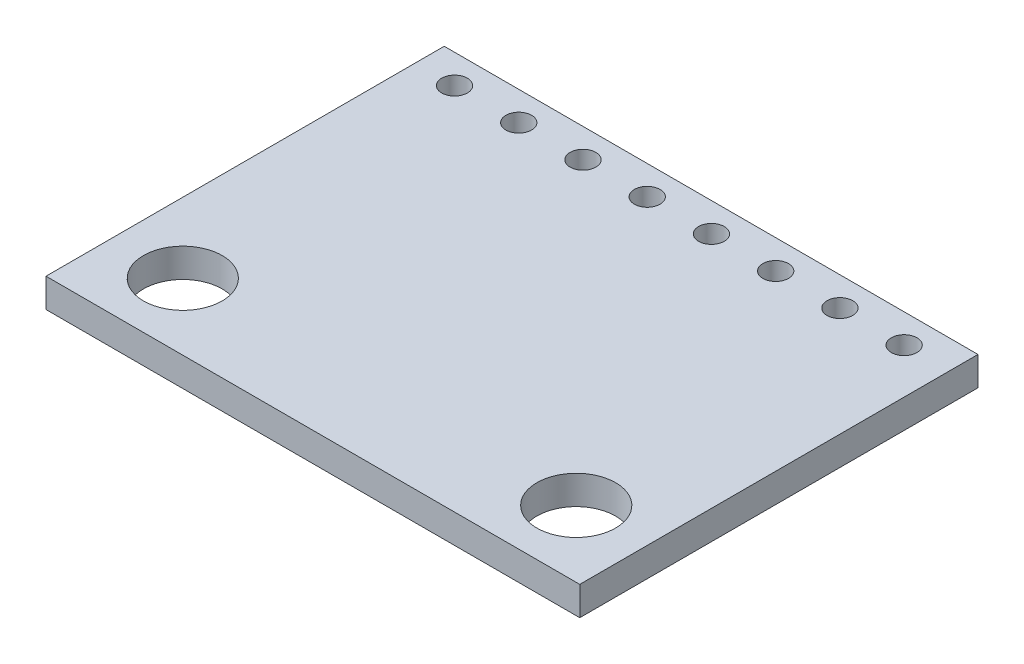
ISO-10303-21;
HEADER;
FILE_DESCRIPTION(('STEP AP214'),'2;1');
FILE_NAME('part.step','',(''),(''),'','','');
FILE_SCHEMA(('AUTOMOTIVE_DESIGN { 1 0 10303 214 1 1 1 1 }'));
ENDSEC;
DATA;
#1=APPLICATION_CONTEXT('core data for automotive mechanical design processes');
#2=APPLICATION_PROTOCOL_DEFINITION('international standard','automotive_design',2000,#1);
#3=PRODUCT_CONTEXT('',#1,'mechanical');
#4=PRODUCT('Part','Part','',(#3));
#5=PRODUCT_RELATED_PRODUCT_CATEGORY('part','',(#4));
#6=PRODUCT_DEFINITION_FORMATION('','',#4);
#7=PRODUCT_DEFINITION_CONTEXT('part definition',#1,'design');
#8=PRODUCT_DEFINITION('design','',#6,#7);
#9=PRODUCT_DEFINITION_SHAPE('','',#8);
#10=(LENGTH_UNIT() NAMED_UNIT(*) SI_UNIT(.MILLI.,.METRE.));
#11=(NAMED_UNIT(*) PLANE_ANGLE_UNIT() SI_UNIT($,.RADIAN.));
#12=(NAMED_UNIT(*) SI_UNIT($,.STERADIAN.) SOLID_ANGLE_UNIT());
#13=UNCERTAINTY_MEASURE_WITH_UNIT(LENGTH_MEASURE(1.E-05),#10,'distance_accuracy_value','');
#14=(GEOMETRIC_REPRESENTATION_CONTEXT(3) GLOBAL_UNCERTAINTY_ASSIGNED_CONTEXT((#13)) GLOBAL_UNIT_ASSIGNED_CONTEXT((#10,
#11,#12)) REPRESENTATION_CONTEXT('',''));
#15=CARTESIAN_POINT('',(0.,0.,0.));
#16=DIRECTION('',(0.,0.,1.));
#17=DIRECTION('',(1.,0.,0.));
#18=AXIS2_PLACEMENT_3D('',#15,#16,#17);
#19=CARTESIAN_POINT('',(0.,0.5715,0.));
#20=DIRECTION('',(0.,-1.,0.));
#21=DIRECTION('',(0.,0.,-1.));
#22=AXIS2_PLACEMENT_3D('',#19,#20,#21);
#23=PLANE('',#22);
#24=CARTESIAN_POINT('',(6.2357,0.5715,-6.731));
#25=DIRECTION('',(0.,1.,0.));
#26=DIRECTION('',(0.,0.,1.));
#27=AXIS2_PLACEMENT_3D('',#24,#25,#26);
#28=CIRCLE('',#27,0.508);
#29=CARTESIAN_POINT('',(6.2357,0.5715,-6.223));
#30=VERTEX_POINT('',#29);
#31=EDGE_CURVE('E161',#30,#30,#28,.T.);
#32=ORIENTED_EDGE('',*,*,#31,.F.);
#33=EDGE_LOOP('',(#32));
#34=FACE_BOUND('',#33,.T.);
#35=CARTESIAN_POINT('',(1.1557,0.5715,-6.731));
#36=DIRECTION('',(0.,1.,0.));
#37=DIRECTION('',(0.,0.,1.));
#38=AXIS2_PLACEMENT_3D('',#35,#36,#37);
#39=CIRCLE('',#38,0.508);
#40=CARTESIAN_POINT('',(1.1557,0.5715,-6.223));
#41=VERTEX_POINT('',#40);
#42=EDGE_CURVE('E149',#41,#41,#39,.T.);
#43=ORIENTED_EDGE('',*,*,#42,.F.);
#44=EDGE_LOOP('',(#43));
#45=FACE_BOUND('',#44,.T.);
#46=CARTESIAN_POINT('',(-3.9243,0.5715,-6.731));
#47=DIRECTION('',(0.,1.,0.));
#48=DIRECTION('',(0.,0.,1.));
#49=AXIS2_PLACEMENT_3D('',#46,#47,#48);
#50=CIRCLE('',#49,0.508);
#51=CARTESIAN_POINT('',(-3.9243,0.5715,-6.223));
#52=VERTEX_POINT('',#51);
#53=EDGE_CURVE('E137',#52,#52,#50,.T.);
#54=ORIENTED_EDGE('',*,*,#53,.F.);
#55=EDGE_LOOP('',(#54));
#56=FACE_BOUND('',#55,.T.);
#57=CARTESIAN_POINT('',(-9.0043,0.5715,-6.731));
#58=DIRECTION('',(0.,1.,0.));
#59=DIRECTION('',(0.,0.,1.));
#60=AXIS2_PLACEMENT_3D('',#57,#58,#59);
#61=CIRCLE('',#60,0.508);
#62=CARTESIAN_POINT('',(-9.0043,0.5715,-6.223));
#63=VERTEX_POINT('',#62);
#64=EDGE_CURVE('E125',#63,#63,#61,.T.);
#65=ORIENTED_EDGE('',*,*,#64,.F.);
#66=EDGE_LOOP('',(#65));
#67=FACE_BOUND('',#66,.T.);
#68=CARTESIAN_POINT('',(-7.77875,0.5715,5.23875));
#69=DIRECTION('',(0.,1.,0.));
#70=DIRECTION('',(0.,0.,1.));
#71=AXIS2_PLACEMENT_3D('',#68,#69,#70);
#72=CIRCLE('',#71,1.55575);
#73=CARTESIAN_POINT('',(-7.77875,0.5715,6.79449999999999));
#74=VERTEX_POINT('',#73);
#75=EDGE_CURVE('E104',#74,#74,#72,.T.);
#76=ORIENTED_EDGE('',*,*,#75,.F.);
#77=EDGE_LOOP('',(#76));
#78=FACE_BOUND('',#77,.T.);
#79=DIRECTION('',(0.,0.,-1.));
#80=VECTOR('',#79,1.);
#81=CARTESIAN_POINT('',(10.5537,0.5715,7.874));
#82=LINE('',#81,#80);
#83=CARTESIAN_POINT('',(10.5537,0.5715,7.874));
#84=VERTEX_POINT('',#83);
#85=CARTESIAN_POINT('',(10.5537,0.5715,-7.874));
#86=VERTEX_POINT('',#85);
#87=EDGE_CURVE('E89',#84,#86,#82,.T.);
#88=ORIENTED_EDGE('',*,*,#87,.T.);
#89=DIRECTION('',(-1.,0.,0.));
#90=VECTOR('',#89,1.);
#91=CARTESIAN_POINT('',(-10.5537,0.5715,-7.874));
#92=LINE('',#91,#90);
#93=CARTESIAN_POINT('',(-10.5537,0.5715,-7.874));
#94=VERTEX_POINT('',#93);
#95=EDGE_CURVE('E84',#86,#94,#92,.T.);
#96=ORIENTED_EDGE('',*,*,#95,.T.);
#97=DIRECTION('',(0.,0.,1.));
#98=VECTOR('',#97,1.);
#99=CARTESIAN_POINT('',(-10.5537,0.5715,7.874));
#100=LINE('',#99,#98);
#101=CARTESIAN_POINT('',(-10.5537,0.5715,7.874));
#102=VERTEX_POINT('',#101);
#103=EDGE_CURVE('E87',#94,#102,#100,.T.);
#104=ORIENTED_EDGE('',*,*,#103,.T.);
#105=DIRECTION('',(1.,0.,0.));
#106=VECTOR('',#105,1.);
#107=CARTESIAN_POINT('',(-10.5537,0.5715,7.874));
#108=LINE('',#107,#106);
#109=EDGE_CURVE('E54',#102,#84,#108,.T.);
#110=ORIENTED_EDGE('',*,*,#109,.T.);
#111=EDGE_LOOP('',(#88,#96,#104,#110));
#112=FACE_BOUND('',#111,.T.);
#113=CARTESIAN_POINT('',(7.77875,0.5715,5.23875));
#114=DIRECTION('',(0.,1.,0.));
#115=DIRECTION('',(0.,0.,-1.));
#116=AXIS2_PLACEMENT_3D('',#113,#114,#115);
#117=CIRCLE('',#116,1.55575);
#118=CARTESIAN_POINT('',(7.77875,0.5715,3.683));
#119=VERTEX_POINT('',#118);
#120=EDGE_CURVE('E119',#119,#119,#117,.T.);
#121=ORIENTED_EDGE('',*,*,#120,.F.);
#122=EDGE_LOOP('',(#121));
#123=FACE_BOUND('',#122,.T.);
#124=CARTESIAN_POINT('',(-6.4643,0.5715,-6.731));
#125=DIRECTION('',(0.,1.,0.));
#126=DIRECTION('',(0.,0.,1.));
#127=AXIS2_PLACEMENT_3D('',#124,#125,#126);
#128=CIRCLE('',#127,0.508);
#129=CARTESIAN_POINT('',(-6.4643,0.5715,-6.223));
#130=VERTEX_POINT('',#129);
#131=EDGE_CURVE('E131',#130,#130,#128,.T.);
#132=ORIENTED_EDGE('',*,*,#131,.F.);
#133=EDGE_LOOP('',(#132));
#134=FACE_BOUND('',#133,.T.);
#135=CARTESIAN_POINT('',(-1.3843,0.5715,-6.731));
#136=DIRECTION('',(0.,1.,0.));
#137=DIRECTION('',(0.,0.,1.));
#138=AXIS2_PLACEMENT_3D('',#135,#136,#137);
#139=CIRCLE('',#138,0.508);
#140=CARTESIAN_POINT('',(-1.3843,0.5715,-6.223));
#141=VERTEX_POINT('',#140);
#142=EDGE_CURVE('E143',#141,#141,#139,.T.);
#143=ORIENTED_EDGE('',*,*,#142,.F.);
#144=EDGE_LOOP('',(#143));
#145=FACE_BOUND('',#144,.T.);
#146=CARTESIAN_POINT('',(3.6957,0.5715,-6.731));
#147=DIRECTION('',(0.,1.,0.));
#148=DIRECTION('',(0.,0.,1.));
#149=AXIS2_PLACEMENT_3D('',#146,#147,#148);
#150=CIRCLE('',#149,0.508);
#151=CARTESIAN_POINT('',(3.6957,0.5715,-6.223));
#152=VERTEX_POINT('',#151);
#153=EDGE_CURVE('E155',#152,#152,#150,.T.);
#154=ORIENTED_EDGE('',*,*,#153,.F.);
#155=EDGE_LOOP('',(#154));
#156=FACE_BOUND('',#155,.T.);
#157=CARTESIAN_POINT('',(8.7757,0.5715,-6.731));
#158=DIRECTION('',(0.,1.,0.));
#159=DIRECTION('',(0.,0.,1.));
#160=AXIS2_PLACEMENT_3D('',#157,#158,#159);
#161=CIRCLE('',#160,0.508);
#162=CARTESIAN_POINT('',(8.7757,0.5715,-6.223));
#163=VERTEX_POINT('',#162);
#164=EDGE_CURVE('E167',#163,#163,#161,.T.);
#165=ORIENTED_EDGE('',*,*,#164,.F.);
#166=EDGE_LOOP('',(#165));
#167=FACE_BOUND('',#166,.T.);
#168=ADVANCED_FACE('F37',(#34,#45,#56,#67,#78,#112,#123,#134,#145,#156,#167),#23,.F.);
#169=CARTESIAN_POINT('',(0.,-0.5715,0.));
#170=DIRECTION('',(0.,-1.,0.));
#171=DIRECTION('',(0.,0.,-1.));
#172=AXIS2_PLACEMENT_3D('',#169,#170,#171);
#173=PLANE('',#172);
#174=CARTESIAN_POINT('',(6.2357,-0.5715,-6.731));
#175=DIRECTION('',(0.,1.,0.));
#176=DIRECTION('',(0.,0.,1.));
#177=AXIS2_PLACEMENT_3D('',#174,#175,#176);
#178=CIRCLE('',#177,0.508);
#179=CARTESIAN_POINT('',(6.2357,-0.5715,-6.223));
#180=VERTEX_POINT('',#179);
#181=EDGE_CURVE('E164',#180,#180,#178,.T.);
#182=ORIENTED_EDGE('',*,*,#181,.T.);
#183=EDGE_LOOP('',(#182));
#184=FACE_BOUND('',#183,.T.);
#185=CARTESIAN_POINT('',(1.1557,-0.5715,-6.731));
#186=DIRECTION('',(0.,1.,0.));
#187=DIRECTION('',(0.,0.,1.));
#188=AXIS2_PLACEMENT_3D('',#185,#186,#187);
#189=CIRCLE('',#188,0.508);
#190=CARTESIAN_POINT('',(1.1557,-0.5715,-6.223));
#191=VERTEX_POINT('',#190);
#192=EDGE_CURVE('E152',#191,#191,#189,.T.);
#193=ORIENTED_EDGE('',*,*,#192,.T.);
#194=EDGE_LOOP('',(#193));
#195=FACE_BOUND('',#194,.T.);
#196=CARTESIAN_POINT('',(-3.9243,-0.5715,-6.731));
#197=DIRECTION('',(0.,1.,0.));
#198=DIRECTION('',(0.,0.,1.));
#199=AXIS2_PLACEMENT_3D('',#196,#197,#198);
#200=CIRCLE('',#199,0.508);
#201=CARTESIAN_POINT('',(-3.9243,-0.5715,-6.223));
#202=VERTEX_POINT('',#201);
#203=EDGE_CURVE('E140',#202,#202,#200,.T.);
#204=ORIENTED_EDGE('',*,*,#203,.T.);
#205=EDGE_LOOP('',(#204));
#206=FACE_BOUND('',#205,.T.);
#207=CARTESIAN_POINT('',(-9.0043,-0.5715,-6.731));
#208=DIRECTION('',(0.,1.,0.));
#209=DIRECTION('',(0.,0.,1.));
#210=AXIS2_PLACEMENT_3D('',#207,#208,#209);
#211=CIRCLE('',#210,0.508);
#212=CARTESIAN_POINT('',(-9.0043,-0.5715,-6.223));
#213=VERTEX_POINT('',#212);
#214=EDGE_CURVE('E128',#213,#213,#211,.T.);
#215=ORIENTED_EDGE('',*,*,#214,.T.);
#216=EDGE_LOOP('',(#215));
#217=FACE_BOUND('',#216,.T.);
#218=CARTESIAN_POINT('',(-7.77875,-0.5715,5.23875));
#219=DIRECTION('',(0.,1.,0.));
#220=DIRECTION('',(0.,0.,1.));
#221=AXIS2_PLACEMENT_3D('',#218,#219,#220);
#222=CIRCLE('',#221,1.55575);
#223=CARTESIAN_POINT('',(-7.77875,-0.5715,6.79449999999999));
#224=VERTEX_POINT('',#223);
#225=EDGE_CURVE('E116',#224,#224,#222,.T.);
#226=ORIENTED_EDGE('',*,*,#225,.T.);
#227=EDGE_LOOP('',(#226));
#228=FACE_BOUND('',#227,.T.);
#229=DIRECTION('',(0.,0.,-1.));
#230=VECTOR('',#229,1.);
#231=CARTESIAN_POINT('',(10.5537,-0.5715,7.874));
#232=LINE('',#231,#230);
#233=CARTESIAN_POINT('',(10.5537,-0.5715,7.874));
#234=VERTEX_POINT('',#233);
#235=CARTESIAN_POINT('',(10.5537,-0.5715,-7.874));
#236=VERTEX_POINT('',#235);
#237=EDGE_CURVE('E101',#234,#236,#232,.T.);
#238=ORIENTED_EDGE('',*,*,#237,.F.);
#239=DIRECTION('',(1.,0.,0.));
#240=VECTOR('',#239,1.);
#241=CARTESIAN_POINT('',(-10.5537,-0.5715,7.874));
#242=LINE('',#241,#240);
#243=CARTESIAN_POINT('',(-10.5537,-0.5715,7.874));
#244=VERTEX_POINT('',#243);
#245=EDGE_CURVE('E77',#244,#234,#242,.T.);
#246=ORIENTED_EDGE('',*,*,#245,.F.);
#247=DIRECTION('',(0.,0.,1.));
#248=VECTOR('',#247,1.);
#249=CARTESIAN_POINT('',(-10.5537,-0.5715,7.874));
#250=LINE('',#249,#248);
#251=CARTESIAN_POINT('',(-10.5537,-0.5715,-7.874));
#252=VERTEX_POINT('',#251);
#253=EDGE_CURVE('E71',#252,#244,#250,.T.);
#254=ORIENTED_EDGE('',*,*,#253,.F.);
#255=DIRECTION('',(-1.,0.,0.));
#256=VECTOR('',#255,1.);
#257=CARTESIAN_POINT('',(-10.5537,-0.5715,-7.874));
#258=LINE('',#257,#256);
#259=EDGE_CURVE('E93',#236,#252,#258,.T.);
#260=ORIENTED_EDGE('',*,*,#259,.F.);
#261=EDGE_LOOP('',(#238,#246,#254,#260));
#262=FACE_BOUND('',#261,.T.);
#263=CARTESIAN_POINT('',(7.77875,-0.5715,5.23875));
#264=DIRECTION('',(0.,1.,0.));
#265=DIRECTION('',(0.,0.,-1.));
#266=AXIS2_PLACEMENT_3D('',#263,#264,#265);
#267=CIRCLE('',#266,1.55575);
#268=CARTESIAN_POINT('',(7.77875,-0.5715,3.683));
#269=VERTEX_POINT('',#268);
#270=EDGE_CURVE('E122',#269,#269,#267,.T.);
#271=ORIENTED_EDGE('',*,*,#270,.T.);
#272=EDGE_LOOP('',(#271));
#273=FACE_BOUND('',#272,.T.);
#274=CARTESIAN_POINT('',(-6.4643,-0.5715,-6.731));
#275=DIRECTION('',(0.,1.,0.));
#276=DIRECTION('',(0.,0.,1.));
#277=AXIS2_PLACEMENT_3D('',#274,#275,#276);
#278=CIRCLE('',#277,0.508);
#279=CARTESIAN_POINT('',(-6.4643,-0.5715,-6.223));
#280=VERTEX_POINT('',#279);
#281=EDGE_CURVE('E134',#280,#280,#278,.T.);
#282=ORIENTED_EDGE('',*,*,#281,.T.);
#283=EDGE_LOOP('',(#282));
#284=FACE_BOUND('',#283,.T.);
#285=CARTESIAN_POINT('',(-1.3843,-0.5715,-6.731));
#286=DIRECTION('',(0.,1.,0.));
#287=DIRECTION('',(0.,0.,1.));
#288=AXIS2_PLACEMENT_3D('',#285,#286,#287);
#289=CIRCLE('',#288,0.508);
#290=CARTESIAN_POINT('',(-1.3843,-0.5715,-6.223));
#291=VERTEX_POINT('',#290);
#292=EDGE_CURVE('E146',#291,#291,#289,.T.);
#293=ORIENTED_EDGE('',*,*,#292,.T.);
#294=EDGE_LOOP('',(#293));
#295=FACE_BOUND('',#294,.T.);
#296=CARTESIAN_POINT('',(3.6957,-0.5715,-6.731));
#297=DIRECTION('',(0.,1.,0.));
#298=DIRECTION('',(0.,0.,1.));
#299=AXIS2_PLACEMENT_3D('',#296,#297,#298);
#300=CIRCLE('',#299,0.508);
#301=CARTESIAN_POINT('',(3.6957,-0.5715,-6.223));
#302=VERTEX_POINT('',#301);
#303=EDGE_CURVE('E158',#302,#302,#300,.T.);
#304=ORIENTED_EDGE('',*,*,#303,.T.);
#305=EDGE_LOOP('',(#304));
#306=FACE_BOUND('',#305,.T.);
#307=CARTESIAN_POINT('',(8.7757,-0.5715,-6.731));
#308=DIRECTION('',(0.,1.,0.));
#309=DIRECTION('',(0.,0.,1.));
#310=AXIS2_PLACEMENT_3D('',#307,#308,#309);
#311=CIRCLE('',#310,0.508);
#312=CARTESIAN_POINT('',(8.7757,-0.5715,-6.223));
#313=VERTEX_POINT('',#312);
#314=EDGE_CURVE('E170',#313,#313,#311,.T.);
#315=ORIENTED_EDGE('',*,*,#314,.T.);
#316=EDGE_LOOP('',(#315));
#317=FACE_BOUND('',#316,.T.);
#318=ADVANCED_FACE('F112',(#184,#195,#206,#217,#228,#262,#273,#284,#295,#306,#317),#173,.T.);
#319=CARTESIAN_POINT('',(10.5537,0.5715,7.874));
#320=DIRECTION('',(-1.,0.,0.));
#321=DIRECTION('',(0.,0.,1.));
#322=AXIS2_PLACEMENT_3D('',#319,#320,#321);
#323=PLANE('',#322);
#324=ORIENTED_EDGE('',*,*,#237,.T.);
#325=DIRECTION('',(0.,-1.,0.));
#326=VECTOR('',#325,1.);
#327=CARTESIAN_POINT('',(10.5537,0.5715,-7.874));
#328=LINE('',#327,#326);
#329=EDGE_CURVE('E11',#86,#236,#328,.T.);
#330=ORIENTED_EDGE('',*,*,#329,.F.);
#331=ORIENTED_EDGE('',*,*,#87,.F.);
#332=DIRECTION('',(0.,-1.,0.));
#333=VECTOR('',#332,1.);
#334=CARTESIAN_POINT('',(10.5537,0.5715,7.874));
#335=LINE('',#334,#333);
#336=EDGE_CURVE('E97',#84,#234,#335,.T.);
#337=ORIENTED_EDGE('',*,*,#336,.T.);
#338=EDGE_LOOP('',(#324,#330,#331,#337));
#339=FACE_BOUND('',#338,.T.);
#340=ADVANCED_FACE('F39',(#339),#323,.F.);
#341=CARTESIAN_POINT('',(-10.5537,0.5715,-7.874));
#342=DIRECTION('',(0.,0.,1.));
#343=DIRECTION('',(1.,0.,0.));
#344=AXIS2_PLACEMENT_3D('',#341,#342,#343);
#345=PLANE('',#344);
#346=ORIENTED_EDGE('',*,*,#259,.T.);
#347=DIRECTION('',(0.,-1.,0.));
#348=VECTOR('',#347,1.);
#349=CARTESIAN_POINT('',(-10.5537,0.5715,-7.874));
#350=LINE('',#349,#348);
#351=EDGE_CURVE('E46',#94,#252,#350,.T.);
#352=ORIENTED_EDGE('',*,*,#351,.F.);
#353=ORIENTED_EDGE('',*,*,#95,.F.);
#354=ORIENTED_EDGE('',*,*,#329,.T.);
#355=EDGE_LOOP('',(#346,#352,#353,#354));
#356=FACE_BOUND('',#355,.T.);
#357=ADVANCED_FACE('F92',(#356),#345,.F.);
#358=CARTESIAN_POINT('',(-10.5537,0.5715,7.874));
#359=DIRECTION('',(1.,0.,0.));
#360=DIRECTION('',(0.,0.,-1.));
#361=AXIS2_PLACEMENT_3D('',#358,#359,#360);
#362=PLANE('',#361);
#363=ORIENTED_EDGE('',*,*,#253,.T.);
#364=DIRECTION('',(0.,-1.,0.));
#365=VECTOR('',#364,1.);
#366=CARTESIAN_POINT('',(-10.5537,0.5715,7.874));
#367=LINE('',#366,#365);
#368=EDGE_CURVE('E94',#102,#244,#367,.T.);
#369=ORIENTED_EDGE('',*,*,#368,.F.);
#370=ORIENTED_EDGE('',*,*,#103,.F.);
#371=ORIENTED_EDGE('',*,*,#351,.T.);
#372=EDGE_LOOP('',(#363,#369,#370,#371));
#373=FACE_BOUND('',#372,.T.);
#374=ADVANCED_FACE('F95',(#373),#362,.F.);
#375=CARTESIAN_POINT('',(-10.5537,0.5715,7.874));
#376=DIRECTION('',(0.,0.,-1.));
#377=DIRECTION('',(-1.,0.,0.));
#378=AXIS2_PLACEMENT_3D('',#375,#376,#377);
#379=PLANE('',#378);
#380=ORIENTED_EDGE('',*,*,#245,.T.);
#381=ORIENTED_EDGE('',*,*,#336,.F.);
#382=ORIENTED_EDGE('',*,*,#109,.F.);
#383=ORIENTED_EDGE('',*,*,#368,.T.);
#384=EDGE_LOOP('',(#380,#381,#382,#383));
#385=FACE_BOUND('',#384,.T.);
#386=ADVANCED_FACE('F109',(#385),#379,.F.);
#387=CARTESIAN_POINT('',(-7.77875,0.5715,5.23875));
#388=DIRECTION('',(0.,-1.,0.));
#389=DIRECTION('',(0.,0.,-1.));
#390=AXIS2_PLACEMENT_3D('',#387,#388,#389);
#391=CYLINDRICAL_SURFACE('',#390,1.55575);
#392=ORIENTED_EDGE('',*,*,#75,.T.);
#393=EDGE_LOOP('',(#392));
#394=FACE_BOUND('',#393,.T.);
#395=ORIENTED_EDGE('',*,*,#225,.F.);
#396=EDGE_LOOP('',(#395));
#397=FACE_BOUND('',#396,.T.);
#398=ADVANCED_FACE('F190',(#394,#397),#391,.F.);
#399=CARTESIAN_POINT('',(7.77875,0.5715,5.23875));
#400=DIRECTION('',(0.,-1.,0.));
#401=DIRECTION('',(0.,0.,-1.));
#402=AXIS2_PLACEMENT_3D('',#399,#400,#401);
#403=CYLINDRICAL_SURFACE('',#402,1.55575);
#404=ORIENTED_EDGE('',*,*,#120,.T.);
#405=EDGE_LOOP('',(#404));
#406=FACE_BOUND('',#405,.T.);
#407=ORIENTED_EDGE('',*,*,#270,.F.);
#408=EDGE_LOOP('',(#407));
#409=FACE_BOUND('',#408,.T.);
#410=ADVANCED_FACE('F214',(#406,#409),#403,.F.);
#411=CARTESIAN_POINT('',(-9.0043,0.5715,-6.731));
#412=DIRECTION('',(0.,-1.,0.));
#413=DIRECTION('',(0.,0.,-1.));
#414=AXIS2_PLACEMENT_3D('',#411,#412,#413);
#415=CYLINDRICAL_SURFACE('',#414,0.508);
#416=ORIENTED_EDGE('',*,*,#64,.T.);
#417=EDGE_LOOP('',(#416));
#418=FACE_BOUND('',#417,.T.);
#419=ORIENTED_EDGE('',*,*,#214,.F.);
#420=EDGE_LOOP('',(#419));
#421=FACE_BOUND('',#420,.T.);
#422=ADVANCED_FACE('F219',(#418,#421),#415,.F.);
#423=CARTESIAN_POINT('',(-6.4643,0.5715,-6.731));
#424=DIRECTION('',(0.,-1.,0.));
#425=DIRECTION('',(0.,0.,-1.));
#426=AXIS2_PLACEMENT_3D('',#423,#424,#425);
#427=CYLINDRICAL_SURFACE('',#426,0.508);
#428=ORIENTED_EDGE('',*,*,#131,.T.);
#429=EDGE_LOOP('',(#428));
#430=FACE_BOUND('',#429,.T.);
#431=ORIENTED_EDGE('',*,*,#281,.F.);
#432=EDGE_LOOP('',(#431));
#433=FACE_BOUND('',#432,.T.);
#434=ADVANCED_FACE('F237',(#430,#433),#427,.F.);
#435=CARTESIAN_POINT('',(-3.9243,0.5715,-6.731));
#436=DIRECTION('',(0.,-1.,0.));
#437=DIRECTION('',(0.,0.,-1.));
#438=AXIS2_PLACEMENT_3D('',#435,#436,#437);
#439=CYLINDRICAL_SURFACE('',#438,0.508);
#440=ORIENTED_EDGE('',*,*,#53,.T.);
#441=EDGE_LOOP('',(#440));
#442=FACE_BOUND('',#441,.T.);
#443=ORIENTED_EDGE('',*,*,#203,.F.);
#444=EDGE_LOOP('',(#443));
#445=FACE_BOUND('',#444,.T.);
#446=ADVANCED_FACE('F247',(#442,#445),#439,.F.);
#447=CARTESIAN_POINT('',(-1.3843,0.5715,-6.731));
#448=DIRECTION('',(0.,-1.,0.));
#449=DIRECTION('',(0.,0.,-1.));
#450=AXIS2_PLACEMENT_3D('',#447,#448,#449);
#451=CYLINDRICAL_SURFACE('',#450,0.508);
#452=ORIENTED_EDGE('',*,*,#142,.T.);
#453=EDGE_LOOP('',(#452));
#454=FACE_BOUND('',#453,.T.);
#455=ORIENTED_EDGE('',*,*,#292,.F.);
#456=EDGE_LOOP('',(#455));
#457=FACE_BOUND('',#456,.T.);
#458=ADVANCED_FACE('F257',(#454,#457),#451,.F.);
#459=CARTESIAN_POINT('',(1.1557,0.5715,-6.731));
#460=DIRECTION('',(0.,-1.,0.));
#461=DIRECTION('',(0.,0.,-1.));
#462=AXIS2_PLACEMENT_3D('',#459,#460,#461);
#463=CYLINDRICAL_SURFACE('',#462,0.508);
#464=ORIENTED_EDGE('',*,*,#42,.T.);
#465=EDGE_LOOP('',(#464));
#466=FACE_BOUND('',#465,.T.);
#467=ORIENTED_EDGE('',*,*,#192,.F.);
#468=EDGE_LOOP('',(#467));
#469=FACE_BOUND('',#468,.T.);
#470=ADVANCED_FACE('F267',(#466,#469),#463,.F.);
#471=CARTESIAN_POINT('',(3.6957,0.5715,-6.731));
#472=DIRECTION('',(0.,-1.,0.));
#473=DIRECTION('',(0.,0.,-1.));
#474=AXIS2_PLACEMENT_3D('',#471,#472,#473);
#475=CYLINDRICAL_SURFACE('',#474,0.508);
#476=ORIENTED_EDGE('',*,*,#153,.T.);
#477=EDGE_LOOP('',(#476));
#478=FACE_BOUND('',#477,.T.);
#479=ORIENTED_EDGE('',*,*,#303,.F.);
#480=EDGE_LOOP('',(#479));
#481=FACE_BOUND('',#480,.T.);
#482=ADVANCED_FACE('F277',(#478,#481),#475,.F.);
#483=CARTESIAN_POINT('',(6.2357,0.5715,-6.731));
#484=DIRECTION('',(0.,-1.,0.));
#485=DIRECTION('',(0.,0.,-1.));
#486=AXIS2_PLACEMENT_3D('',#483,#484,#485);
#487=CYLINDRICAL_SURFACE('',#486,0.508);
#488=ORIENTED_EDGE('',*,*,#31,.T.);
#489=EDGE_LOOP('',(#488));
#490=FACE_BOUND('',#489,.T.);
#491=ORIENTED_EDGE('',*,*,#181,.F.);
#492=EDGE_LOOP('',(#491));
#493=FACE_BOUND('',#492,.T.);
#494=ADVANCED_FACE('F287',(#490,#493),#487,.F.);
#495=CARTESIAN_POINT('',(8.7757,0.5715,-6.731));
#496=DIRECTION('',(0.,-1.,0.));
#497=DIRECTION('',(0.,0.,-1.));
#498=AXIS2_PLACEMENT_3D('',#495,#496,#497);
#499=CYLINDRICAL_SURFACE('',#498,0.508);
#500=ORIENTED_EDGE('',*,*,#164,.T.);
#501=EDGE_LOOP('',(#500));
#502=FACE_BOUND('',#501,.T.);
#503=ORIENTED_EDGE('',*,*,#314,.F.);
#504=EDGE_LOOP('',(#503));
#505=FACE_BOUND('',#504,.T.);
#506=ADVANCED_FACE('F176',(#502,#505),#499,.F.);
#507=CLOSED_SHELL('',(#168,#318,#340,#357,#374,#386,#398,#410,#422,#434,#446,#458,#470,#482,
#494,#506));
#508=MANIFOLD_SOLID_BREP('B2',#507);
#509=ADVANCED_BREP_SHAPE_REPRESENTATION('',(#18,#508),#14);
#510=SHAPE_DEFINITION_REPRESENTATION(#9,#509);
ENDSEC;
END-ISO-10303-21;
